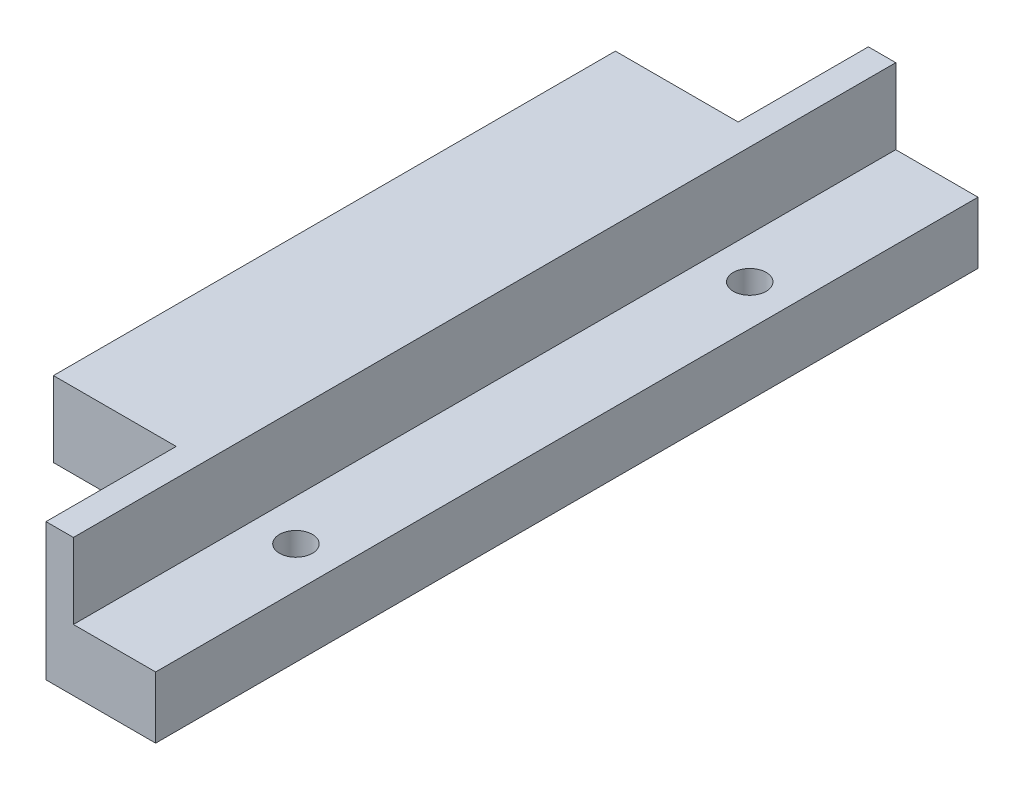
ISO-10303-21;
HEADER;
FILE_DESCRIPTION(('STEP AP214'),'2;1');
FILE_NAME('part.step','',(''),(''),'','','');
FILE_SCHEMA(('AUTOMOTIVE_DESIGN { 1 0 10303 214 1 1 1 1 }'));
ENDSEC;
DATA;
#1=APPLICATION_CONTEXT('core data for automotive mechanical design processes');
#2=APPLICATION_PROTOCOL_DEFINITION('international standard','automotive_design',2000,#1);
#3=PRODUCT_CONTEXT('',#1,'mechanical');
#4=PRODUCT('Part','Part','',(#3));
#5=PRODUCT_RELATED_PRODUCT_CATEGORY('part','',(#4));
#6=PRODUCT_DEFINITION_FORMATION('','',#4);
#7=PRODUCT_DEFINITION_CONTEXT('part definition',#1,'design');
#8=PRODUCT_DEFINITION('design','',#6,#7);
#9=PRODUCT_DEFINITION_SHAPE('','',#8);
#10=(LENGTH_UNIT() NAMED_UNIT(*) SI_UNIT(.MILLI.,.METRE.));
#11=(NAMED_UNIT(*) PLANE_ANGLE_UNIT() SI_UNIT($,.RADIAN.));
#12=(NAMED_UNIT(*) SI_UNIT($,.STERADIAN.) SOLID_ANGLE_UNIT());
#13=UNCERTAINTY_MEASURE_WITH_UNIT(LENGTH_MEASURE(1.E-05),#10,'distance_accuracy_value','');
#14=(GEOMETRIC_REPRESENTATION_CONTEXT(3) GLOBAL_UNCERTAINTY_ASSIGNED_CONTEXT((#13)) GLOBAL_UNIT_ASSIGNED_CONTEXT((#10,
#11,#12)) REPRESENTATION_CONTEXT('',''));
#15=CARTESIAN_POINT('',(0.,0.,0.));
#16=DIRECTION('',(0.,0.,1.));
#17=DIRECTION('',(1.,0.,0.));
#18=AXIS2_PLACEMENT_3D('',#15,#16,#17);
#19=CARTESIAN_POINT('',(0.,4.5,0.));
#20=DIRECTION('',(0.,1.,0.));
#21=DIRECTION('',(0.,0.,1.));
#22=AXIS2_PLACEMENT_3D('',#19,#20,#21);
#23=PLANE('',#22);
#24=DIRECTION('',(1.,0.,0.));
#25=VECTOR('',#24,1.);
#26=CARTESIAN_POINT('',(0.,4.5,-2.19044505921079));
#27=LINE('',#26,#25);
#28=CARTESIAN_POINT('',(-10.2777777777778,4.5,-2.19044505921079));
#29=VERTEX_POINT('',#28);
#30=CARTESIAN_POINT('',(-5.77777777777779,4.5,-2.19044505921079));
#31=VERTEX_POINT('',#30);
#32=EDGE_CURVE('E216',#29,#31,#27,.T.);
#33=ORIENTED_EDGE('',*,*,#32,.T.);
#34=DIRECTION('',(0.,0.,1.));
#35=VECTOR('',#34,1.);
#36=CARTESIAN_POINT('',(-5.77777777777779,4.5,3.80955494078921));
#37=LINE('',#36,#35);
#38=CARTESIAN_POINT('',(-5.77777777777779,4.5,-5.69044505921079));
#39=VERTEX_POINT('',#38);
#40=EDGE_CURVE('E186',#39,#31,#37,.T.);
#41=ORIENTED_EDGE('',*,*,#40,.F.);
#42=DIRECTION('',(1.,0.,0.));
#43=VECTOR('',#42,1.);
#44=CARTESIAN_POINT('',(-10.7347815598972,4.5,-5.69044505921079));
#45=LINE('',#44,#43);
#46=CARTESIAN_POINT('',(-10.2777777777778,4.5,-5.69044505921079));
#47=VERTEX_POINT('',#46);
#48=EDGE_CURVE('E11',#47,#39,#45,.T.);
#49=ORIENTED_EDGE('',*,*,#48,.F.);
#50=DIRECTION('',(0.,0.,1.));
#51=VECTOR('',#50,1.);
#52=CARTESIAN_POINT('',(-10.2777777777778,4.5,0.));
#53=LINE('',#52,#51);
#54=EDGE_CURVE('E94',#47,#29,#53,.T.);
#55=ORIENTED_EDGE('',*,*,#54,.T.);
#56=EDGE_LOOP('',(#33,#41,#49,#55));
#57=FACE_BOUND('',#56,.T.);
#58=ADVANCED_FACE('F35',(#57),#23,.T.);
#59=DIRECTION('',(-1.,0.,0.));
#60=VECTOR('',#59,1.);
#61=CARTESIAN_POINT('',(-10.7347815598972,4.5,-46.6904450592108));
#62=LINE('',#61,#60);
#63=CARTESIAN_POINT('',(-5.77777777777779,4.5,-46.6904450592108));
#64=VERTEX_POINT('',#63);
#65=CARTESIAN_POINT('',(-10.2777777777778,4.5,-46.6904450592108));
#66=VERTEX_POINT('',#65);
#67=EDGE_CURVE('E211',#64,#66,#62,.T.);
#68=ORIENTED_EDGE('',*,*,#67,.F.);
#69=CARTESIAN_POINT('',(-5.77777777777779,4.5,-50.1904450592108));
#70=VERTEX_POINT('',#69);
#71=EDGE_CURVE('E199',#70,#64,#37,.T.);
#72=ORIENTED_EDGE('',*,*,#71,.F.);
#73=DIRECTION('',(1.,0.,0.));
#74=VECTOR('',#73,1.);
#75=CARTESIAN_POINT('',(0.,4.5,-50.1904450592108));
#76=LINE('',#75,#74);
#77=CARTESIAN_POINT('',(-10.2777777777778,4.5,-50.1904450592108));
#78=VERTEX_POINT('',#77);
#79=EDGE_CURVE('E226',#78,#70,#76,.T.);
#80=ORIENTED_EDGE('',*,*,#79,.F.);
#81=EDGE_CURVE('E213',#78,#66,#53,.T.);
#82=ORIENTED_EDGE('',*,*,#81,.T.);
#83=EDGE_LOOP('',(#68,#72,#80,#82));
#84=FACE_BOUND('',#83,.T.);
#85=ADVANCED_FACE('F304',(#84),#23,.T.);
#86=CARTESIAN_POINT('',(-0.754308825333401,4.5,-9.40353781089534));
#87=DIRECTION('',(0.,1.,0.));
#88=DIRECTION('',(0.,0.,1.));
#89=AXIS2_PLACEMENT_3D('',#86,#87,#88);
#90=CIRCLE('',#89,1.19999999999999);
#91=CARTESIAN_POINT('',(-0.754308825333401,4.5,-8.20353781089535));
#92=VERTEX_POINT('',#91);
#93=EDGE_CURVE('E337',#92,#92,#90,.T.);
#94=ORIENTED_EDGE('',*,*,#93,.F.);
#95=EDGE_LOOP('',(#94));
#96=FACE_BOUND('',#95,.T.);
#97=CARTESIAN_POINT('',(-0.754308825333401,4.5,-42.5115439540475));
#98=DIRECTION('',(0.,1.,0.));
#99=DIRECTION('',(0.,0.,1.));
#100=AXIS2_PLACEMENT_3D('',#97,#98,#99);
#101=CIRCLE('',#100,1.19999999999999);
#102=CARTESIAN_POINT('',(-0.754308825333401,4.5,-41.3115439540475));
#103=VERTEX_POINT('',#102);
#104=EDGE_CURVE('E180',#103,#103,#101,.T.);
#105=ORIENTED_EDGE('',*,*,#104,.F.);
#106=EDGE_LOOP('',(#105));
#107=FACE_BOUND('',#106,.T.);
#108=DIRECTION('',(1.,0.,0.));
#109=VECTOR('',#108,1.);
#110=CARTESIAN_POINT('',(0.,4.5,-56.1904450592108));
#111=LINE('',#110,#109);
#112=CARTESIAN_POINT('',(-3.77777777777779,4.5,-56.1904450592108));
#113=VERTEX_POINT('',#112);
#114=CARTESIAN_POINT('',(2.22222222222221,4.5,-56.1904450592108));
#115=VERTEX_POINT('',#114);
#116=EDGE_CURVE('E224',#113,#115,#111,.T.);
#117=ORIENTED_EDGE('',*,*,#116,.F.);
#118=DIRECTION('',(0.,0.,-1.));
#119=VECTOR('',#118,1.);
#120=CARTESIAN_POINT('',(-3.77777777777779,4.5,3.80955494078921));
#121=LINE('',#120,#119);
#122=CARTESIAN_POINT('',(-3.77777777777779,4.5,3.80955494078921));
#123=VERTEX_POINT('',#122);
#124=EDGE_CURVE('E200',#123,#113,#121,.T.);
#125=ORIENTED_EDGE('',*,*,#124,.F.);
#126=DIRECTION('',(1.,0.,0.));
#127=VECTOR('',#126,1.);
#128=CARTESIAN_POINT('',(0.,4.5,3.80955494078921));
#129=LINE('',#128,#127);
#130=CARTESIAN_POINT('',(2.22222222222222,4.5,3.80955494078921));
#131=VERTEX_POINT('',#130);
#132=EDGE_CURVE('E219',#123,#131,#129,.T.);
#133=ORIENTED_EDGE('',*,*,#132,.T.);
#134=DIRECTION('',(0.,0.,1.));
#135=VECTOR('',#134,1.);
#136=CARTESIAN_POINT('',(2.22222222222222,4.5,0.));
#137=LINE('',#136,#135);
#138=EDGE_CURVE('E221',#115,#131,#137,.T.);
#139=ORIENTED_EDGE('',*,*,#138,.F.);
#140=EDGE_LOOP('',(#117,#125,#133,#139));
#141=FACE_BOUND('',#140,.T.);
#142=ADVANCED_FACE('F323',(#96,#107,#141),#23,.T.);
#143=CARTESIAN_POINT('',(-10.7347815598972,10.,-46.6904450592108));
#144=DIRECTION('',(0.,0.,1.));
#145=DIRECTION('',(1.,0.,0.));
#146=AXIS2_PLACEMENT_3D('',#143,#144,#145);
#147=PLANE('',#146);
#148=DIRECTION('',(0.,1.,0.));
#149=VECTOR('',#148,1.);
#150=CARTESIAN_POINT('',(-5.77777777777779,10.,-46.6904450592108));
#151=LINE('',#150,#149);
#152=CARTESIAN_POINT('',(-5.77777777777779,10.,-46.6904450592108));
#153=VERTEX_POINT('',#152);
#154=EDGE_CURVE('E207',#64,#153,#151,.T.);
#155=ORIENTED_EDGE('',*,*,#154,.F.);
#156=ORIENTED_EDGE('',*,*,#67,.T.);
#157=CARTESIAN_POINT('',(-14.7347815598972,4.5,-46.6904450592108));
#158=VERTEX_POINT('',#157);
#159=EDGE_CURVE('E209',#66,#158,#62,.T.);
#160=ORIENTED_EDGE('',*,*,#159,.T.);
#161=DIRECTION('',(0.,-1.,0.));
#162=VECTOR('',#161,1.);
#163=CARTESIAN_POINT('',(-14.7347815598972,10.,-46.6904450592108));
#164=LINE('',#163,#162);
#165=CARTESIAN_POINT('',(-14.7347815598972,10.,-46.6904450592108));
#166=VERTEX_POINT('',#165);
#167=EDGE_CURVE('E171',#166,#158,#164,.T.);
#168=ORIENTED_EDGE('',*,*,#167,.F.);
#169=DIRECTION('',(-1.,0.,0.));
#170=VECTOR('',#169,1.);
#171=CARTESIAN_POINT('',(-10.7347815598972,10.,-46.6904450592108));
#172=LINE('',#171,#170);
#173=EDGE_CURVE('E161',#153,#166,#172,.T.);
#174=ORIENTED_EDGE('',*,*,#173,.F.);
#175=EDGE_LOOP('',(#155,#156,#160,#168,#174));
#176=FACE_BOUND('',#175,.T.);
#177=ADVANCED_FACE('F302',(#176),#147,.F.);
#178=CARTESIAN_POINT('',(-10.7347815598972,10.,-5.69044505921079));
#179=DIRECTION('',(0.,0.,-1.));
#180=DIRECTION('',(-1.,0.,0.));
#181=AXIS2_PLACEMENT_3D('',#178,#179,#180);
#182=PLANE('',#181);
#183=DIRECTION('',(0.,-1.,0.));
#184=VECTOR('',#183,1.);
#185=CARTESIAN_POINT('',(-5.77777777777779,10.,-5.69044505921079));
#186=LINE('',#185,#184);
#187=CARTESIAN_POINT('',(-5.77777777777779,10.,-5.69044505921079));
#188=VERTEX_POINT('',#187);
#189=EDGE_CURVE('E157',#188,#39,#186,.T.);
#190=ORIENTED_EDGE('',*,*,#189,.F.);
#191=DIRECTION('',(1.,0.,0.));
#192=VECTOR('',#191,1.);
#193=CARTESIAN_POINT('',(-10.7347815598972,10.,-5.69044505921079));
#194=LINE('',#193,#192);
#195=CARTESIAN_POINT('',(-14.7347815598972,10.,-5.69044505921079));
#196=VERTEX_POINT('',#195);
#197=EDGE_CURVE('E151',#196,#188,#194,.T.);
#198=ORIENTED_EDGE('',*,*,#197,.F.);
#199=DIRECTION('',(0.,1.,0.));
#200=VECTOR('',#199,1.);
#201=CARTESIAN_POINT('',(-14.7347815598972,10.,-5.69044505921079));
#202=LINE('',#201,#200);
#203=CARTESIAN_POINT('',(-14.7347815598972,4.5,-5.69044505921078));
#204=VERTEX_POINT('',#203);
#205=EDGE_CURVE('E156',#204,#196,#202,.T.);
#206=ORIENTED_EDGE('',*,*,#205,.F.);
#207=EDGE_CURVE('E45',#204,#47,#45,.T.);
#208=ORIENTED_EDGE('',*,*,#207,.T.);
#209=ORIENTED_EDGE('',*,*,#48,.T.);
#210=EDGE_LOOP('',(#190,#198,#206,#208,#209));
#211=FACE_BOUND('',#210,.T.);
#212=ADVANCED_FACE('F153',(#211),#182,.F.);
#213=CARTESIAN_POINT('',(-10.2777777777778,4.5,0.));
#214=DIRECTION('',(1.,0.,0.));
#215=DIRECTION('',(0.,0.,-1.));
#216=AXIS2_PLACEMENT_3D('',#213,#214,#215);
#217=PLANE('',#216);
#218=DIRECTION('',(0.,0.,1.));
#219=VECTOR('',#218,1.);
#220=CARTESIAN_POINT('',(-10.2777777777778,0.,0.));
#221=LINE('',#220,#219);
#222=CARTESIAN_POINT('',(-10.2777777777778,0.,-50.1904450592108));
#223=VERTEX_POINT('',#222);
#224=CARTESIAN_POINT('',(-10.2777777777778,0.,-2.19044505921079));
#225=VERTEX_POINT('',#224);
#226=EDGE_CURVE('E160',#223,#225,#221,.T.);
#227=ORIENTED_EDGE('',*,*,#226,.T.);
#228=DIRECTION('',(0.,-1.,0.));
#229=VECTOR('',#228,1.);
#230=CARTESIAN_POINT('',(-10.2777777777778,4.5,-2.19044505921079));
#231=LINE('',#230,#229);
#232=EDGE_CURVE('E39',#29,#225,#231,.T.);
#233=ORIENTED_EDGE('',*,*,#232,.F.);
#234=ORIENTED_EDGE('',*,*,#54,.F.);
#235=EDGE_CURVE('E217',#66,#47,#53,.T.);
#236=ORIENTED_EDGE('',*,*,#235,.F.);
#237=ORIENTED_EDGE('',*,*,#81,.F.);
#238=DIRECTION('',(0.,-1.,0.));
#239=VECTOR('',#238,1.);
#240=CARTESIAN_POINT('',(-10.2777777777778,4.5,-50.1904450592108));
#241=LINE('',#240,#239);
#242=EDGE_CURVE('E59',#78,#223,#241,.T.);
#243=ORIENTED_EDGE('',*,*,#242,.T.);
#244=EDGE_LOOP('',(#227,#233,#234,#236,#237,#243));
#245=FACE_BOUND('',#244,.T.);
#246=ADVANCED_FACE('F37',(#245),#217,.F.);
#247=CARTESIAN_POINT('',(0.,4.5,-2.19044505921079));
#248=DIRECTION('',(0.,0.,-1.));
#249=DIRECTION('',(-1.,0.,0.));
#250=AXIS2_PLACEMENT_3D('',#247,#248,#249);
#251=PLANE('',#250);
#252=DIRECTION('',(1.,0.,0.));
#253=VECTOR('',#252,1.);
#254=CARTESIAN_POINT('',(0.,0.,-2.19044505921079));
#255=LINE('',#254,#253);
#256=CARTESIAN_POINT('',(-5.77777777777779,0.,-2.19044505921079));
#257=VERTEX_POINT('',#256);
#258=EDGE_CURVE('E229',#225,#257,#255,.T.);
#259=ORIENTED_EDGE('',*,*,#258,.T.);
#260=DIRECTION('',(0.,-1.,0.));
#261=VECTOR('',#260,1.);
#262=CARTESIAN_POINT('',(-5.77777777777779,4.5,-2.19044505921079));
#263=LINE('',#262,#261);
#264=EDGE_CURVE('E257',#31,#257,#263,.T.);
#265=ORIENTED_EDGE('',*,*,#264,.F.);
#266=ORIENTED_EDGE('',*,*,#32,.F.);
#267=ORIENTED_EDGE('',*,*,#232,.T.);
#268=EDGE_LOOP('',(#259,#265,#266,#267));
#269=FACE_BOUND('',#268,.T.);
#270=ADVANCED_FACE('F265',(#269),#251,.F.);
#271=CARTESIAN_POINT('',(-5.77777777777779,4.5,0.));
#272=DIRECTION('',(1.,0.,0.));
#273=DIRECTION('',(0.,0.,-1.));
#274=AXIS2_PLACEMENT_3D('',#271,#272,#273);
#275=PLANE('',#274);
#276=DIRECTION('',(0.,0.,1.));
#277=VECTOR('',#276,1.);
#278=CARTESIAN_POINT('',(-5.77777777777779,0.,0.));
#279=LINE('',#278,#277);
#280=CARTESIAN_POINT('',(-5.77777777777778,0.,3.80955494078921));
#281=VERTEX_POINT('',#280);
#282=EDGE_CURVE('E231',#257,#281,#279,.T.);
#283=ORIENTED_EDGE('',*,*,#282,.T.);
#284=DIRECTION('',(0.,-1.,0.));
#285=VECTOR('',#284,1.);
#286=CARTESIAN_POINT('',(-5.77777777777778,4.5,3.80955494078921));
#287=LINE('',#286,#285);
#288=CARTESIAN_POINT('',(-5.77777777777779,10.,3.80955494078921));
#289=VERTEX_POINT('',#288);
#290=EDGE_CURVE('E255',#289,#281,#287,.T.);
#291=ORIENTED_EDGE('',*,*,#290,.F.);
#292=DIRECTION('',(0.,0.,1.));
#293=VECTOR('',#292,1.);
#294=CARTESIAN_POINT('',(-5.77777777777779,10.,3.80955494078921));
#295=LINE('',#294,#293);
#296=EDGE_CURVE('E190',#188,#289,#295,.T.);
#297=ORIENTED_EDGE('',*,*,#296,.F.);
#298=ORIENTED_EDGE('',*,*,#189,.T.);
#299=ORIENTED_EDGE('',*,*,#40,.T.);
#300=ORIENTED_EDGE('',*,*,#264,.T.);
#301=EDGE_LOOP('',(#283,#291,#297,#298,#299,#300));
#302=FACE_BOUND('',#301,.T.);
#303=ADVANCED_FACE('F293',(#302),#275,.F.);
#304=CARTESIAN_POINT('',(0.,4.5,3.80955494078921));
#305=DIRECTION('',(0.,0.,-1.));
#306=DIRECTION('',(-1.,0.,0.));
#307=AXIS2_PLACEMENT_3D('',#304,#305,#306);
#308=PLANE('',#307);
#309=DIRECTION('',(1.,0.,0.));
#310=VECTOR('',#309,1.);
#311=CARTESIAN_POINT('',(0.,0.,3.80955494078921));
#312=LINE('',#311,#310);
#313=CARTESIAN_POINT('',(2.22222222222222,0.,3.80955494078921));
#314=VERTEX_POINT('',#313);
#315=EDGE_CURVE('E233',#281,#314,#312,.T.);
#316=ORIENTED_EDGE('',*,*,#315,.T.);
#317=DIRECTION('',(0.,-1.,0.));
#318=VECTOR('',#317,1.);
#319=CARTESIAN_POINT('',(2.22222222222222,4.5,3.80955494078921));
#320=LINE('',#319,#318);
#321=EDGE_CURVE('E253',#131,#314,#320,.T.);
#322=ORIENTED_EDGE('',*,*,#321,.F.);
#323=ORIENTED_EDGE('',*,*,#132,.F.);
#324=DIRECTION('',(0.,-1.,0.));
#325=VECTOR('',#324,1.);
#326=CARTESIAN_POINT('',(-3.77777777777779,10.,3.80955494078921));
#327=LINE('',#326,#325);
#328=CARTESIAN_POINT('',(-3.77777777777779,10.,3.80955494078921));
#329=VERTEX_POINT('',#328);
#330=EDGE_CURVE('E204',#329,#123,#327,.T.);
#331=ORIENTED_EDGE('',*,*,#330,.F.);
#332=DIRECTION('',(1.,0.,0.));
#333=VECTOR('',#332,1.);
#334=CARTESIAN_POINT('',(-3.77777777777779,10.,3.80955494078921));
#335=LINE('',#334,#333);
#336=EDGE_CURVE('E189',#289,#329,#335,.T.);
#337=ORIENTED_EDGE('',*,*,#336,.F.);
#338=ORIENTED_EDGE('',*,*,#290,.T.);
#339=EDGE_LOOP('',(#316,#322,#323,#331,#337,#338));
#340=FACE_BOUND('',#339,.T.);
#341=ADVANCED_FACE('F289',(#340),#308,.F.);
#342=CARTESIAN_POINT('',(2.22222222222222,4.5,0.));
#343=DIRECTION('',(1.,0.,0.));
#344=DIRECTION('',(0.,0.,-1.));
#345=AXIS2_PLACEMENT_3D('',#342,#343,#344);
#346=PLANE('',#345);
#347=DIRECTION('',(0.,0.,1.));
#348=VECTOR('',#347,1.);
#349=CARTESIAN_POINT('',(2.22222222222222,0.,0.));
#350=LINE('',#349,#348);
#351=CARTESIAN_POINT('',(2.22222222222221,0.,-56.1904450592108));
#352=VERTEX_POINT('',#351);
#353=EDGE_CURVE('E237',#352,#314,#350,.T.);
#354=ORIENTED_EDGE('',*,*,#353,.F.);
#355=DIRECTION('',(0.,-1.,0.));
#356=VECTOR('',#355,1.);
#357=CARTESIAN_POINT('',(2.22222222222221,4.5,-56.1904450592108));
#358=LINE('',#357,#356);
#359=EDGE_CURVE('E251',#115,#352,#358,.T.);
#360=ORIENTED_EDGE('',*,*,#359,.F.);
#361=ORIENTED_EDGE('',*,*,#138,.T.);
#362=ORIENTED_EDGE('',*,*,#321,.T.);
#363=EDGE_LOOP('',(#354,#360,#361,#362));
#364=FACE_BOUND('',#363,.T.);
#365=ADVANCED_FACE('F285',(#364),#346,.T.);
#366=CARTESIAN_POINT('',(0.,4.5,-56.1904450592108));
#367=DIRECTION('',(0.,0.,-1.));
#368=DIRECTION('',(-1.,0.,0.));
#369=AXIS2_PLACEMENT_3D('',#366,#367,#368);
#370=PLANE('',#369);
#371=DIRECTION('',(1.,0.,0.));
#372=VECTOR('',#371,1.);
#373=CARTESIAN_POINT('',(0.,0.,-56.1904450592108));
#374=LINE('',#373,#372);
#375=CARTESIAN_POINT('',(-5.77777777777779,0.,-56.1904450592108));
#376=VERTEX_POINT('',#375);
#377=EDGE_CURVE('E240',#376,#352,#374,.T.);
#378=ORIENTED_EDGE('',*,*,#377,.F.);
#379=DIRECTION('',(0.,-1.,0.));
#380=VECTOR('',#379,1.);
#381=CARTESIAN_POINT('',(-5.77777777777779,4.5,-56.1904450592108));
#382=LINE('',#381,#380);
#383=CARTESIAN_POINT('',(-5.77777777777779,10.,-56.1904450592108));
#384=VERTEX_POINT('',#383);
#385=EDGE_CURVE('E249',#384,#376,#382,.T.);
#386=ORIENTED_EDGE('',*,*,#385,.F.);
#387=DIRECTION('',(-1.,0.,0.));
#388=VECTOR('',#387,1.);
#389=CARTESIAN_POINT('',(-3.77777777777779,10.,-56.1904450592108));
#390=LINE('',#389,#388);
#391=CARTESIAN_POINT('',(-3.77777777777779,10.,-56.1904450592108));
#392=VERTEX_POINT('',#391);
#393=EDGE_CURVE('E194',#392,#384,#390,.T.);
#394=ORIENTED_EDGE('',*,*,#393,.F.);
#395=DIRECTION('',(0.,-1.,0.));
#396=VECTOR('',#395,1.);
#397=CARTESIAN_POINT('',(-3.77777777777779,10.,-56.1904450592108));
#398=LINE('',#397,#396);
#399=EDGE_CURVE('E197',#392,#113,#398,.T.);
#400=ORIENTED_EDGE('',*,*,#399,.T.);
#401=ORIENTED_EDGE('',*,*,#116,.T.);
#402=ORIENTED_EDGE('',*,*,#359,.T.);
#403=EDGE_LOOP('',(#378,#386,#394,#400,#401,#402));
#404=FACE_BOUND('',#403,.T.);
#405=ADVANCED_FACE('F278',(#404),#370,.T.);
#406=CARTESIAN_POINT('',(-5.77777777777779,0.,-50.1904450592108));
#407=VERTEX_POINT('',#406);
#408=EDGE_CURVE('E234',#376,#407,#279,.T.);
#409=ORIENTED_EDGE('',*,*,#408,.T.);
#410=DIRECTION('',(0.,-1.,0.));
#411=VECTOR('',#410,1.);
#412=CARTESIAN_POINT('',(-5.77777777777779,4.5,-50.1904450592108));
#413=LINE('',#412,#411);
#414=EDGE_CURVE('E247',#70,#407,#413,.T.);
#415=ORIENTED_EDGE('',*,*,#414,.F.);
#416=ORIENTED_EDGE('',*,*,#71,.T.);
#417=ORIENTED_EDGE('',*,*,#154,.T.);
#418=EDGE_CURVE('E187',#384,#153,#295,.T.);
#419=ORIENTED_EDGE('',*,*,#418,.F.);
#420=ORIENTED_EDGE('',*,*,#385,.T.);
#421=EDGE_LOOP('',(#409,#415,#416,#417,#419,#420));
#422=FACE_BOUND('',#421,.T.);
#423=ADVANCED_FACE('F274',(#422),#275,.F.);
#424=CARTESIAN_POINT('',(0.,4.5,-50.1904450592108));
#425=DIRECTION('',(0.,0.,-1.));
#426=DIRECTION('',(-1.,0.,0.));
#427=AXIS2_PLACEMENT_3D('',#424,#425,#426);
#428=PLANE('',#427);
#429=DIRECTION('',(1.,0.,0.));
#430=VECTOR('',#429,1.);
#431=CARTESIAN_POINT('',(0.,0.,-50.1904450592108));
#432=LINE('',#431,#430);
#433=EDGE_CURVE('E243',#223,#407,#432,.T.);
#434=ORIENTED_EDGE('',*,*,#433,.F.);
#435=ORIENTED_EDGE('',*,*,#242,.F.);
#436=ORIENTED_EDGE('',*,*,#79,.T.);
#437=ORIENTED_EDGE('',*,*,#414,.T.);
#438=EDGE_LOOP('',(#434,#435,#436,#437));
#439=FACE_BOUND('',#438,.T.);
#440=ADVANCED_FACE('F269',(#439),#428,.T.);
#441=CARTESIAN_POINT('',(0.,0.,0.));
#442=DIRECTION('',(0.,1.,0.));
#443=DIRECTION('',(0.,0.,1.));
#444=AXIS2_PLACEMENT_3D('',#441,#442,#443);
#445=PLANE('',#444);
#446=CARTESIAN_POINT('',(-0.754308825333401,0.,-9.40353781089534));
#447=DIRECTION('',(0.,1.,0.));
#448=DIRECTION('',(0.,0.,1.));
#449=AXIS2_PLACEMENT_3D('',#446,#447,#448);
#450=CIRCLE('',#449,1.2);
#451=CARTESIAN_POINT('',(-0.754308825333401,0.,-8.20353781089534));
#452=VERTEX_POINT('',#451);
#453=EDGE_CURVE('E342',#452,#452,#450,.T.);
#454=ORIENTED_EDGE('',*,*,#453,.T.);
#455=EDGE_LOOP('',(#454));
#456=FACE_BOUND('',#455,.T.);
#457=CARTESIAN_POINT('',(-0.754308825333401,0.,-42.5115439540475));
#458=DIRECTION('',(0.,1.,0.));
#459=DIRECTION('',(0.,0.,1.));
#460=AXIS2_PLACEMENT_3D('',#457,#458,#459);
#461=CIRCLE('',#460,1.2);
#462=CARTESIAN_POINT('',(-0.754308825333401,0.,-41.3115439540475));
#463=VERTEX_POINT('',#462);
#464=EDGE_CURVE('E177',#463,#463,#461,.T.);
#465=ORIENTED_EDGE('',*,*,#464,.T.);
#466=EDGE_LOOP('',(#465));
#467=FACE_BOUND('',#466,.T.);
#468=ORIENTED_EDGE('',*,*,#226,.F.);
#469=ORIENTED_EDGE('',*,*,#433,.T.);
#470=ORIENTED_EDGE('',*,*,#408,.F.);
#471=ORIENTED_EDGE('',*,*,#377,.T.);
#472=ORIENTED_EDGE('',*,*,#353,.T.);
#473=ORIENTED_EDGE('',*,*,#315,.F.);
#474=ORIENTED_EDGE('',*,*,#282,.F.);
#475=ORIENTED_EDGE('',*,*,#258,.F.);
#476=EDGE_LOOP('',(#468,#469,#470,#471,#472,#473,#474,#475));
#477=FACE_BOUND('',#476,.T.);
#478=ADVANCED_FACE('F267',(#456,#467,#477),#445,.F.);
#479=CARTESIAN_POINT('',(0.,4.5,0.));
#480=DIRECTION('',(0.,1.,0.));
#481=DIRECTION('',(0.,0.,1.));
#482=AXIS2_PLACEMENT_3D('',#479,#480,#481);
#483=PLANE('',#482);
#484=ORIENTED_EDGE('',*,*,#159,.F.);
#485=ORIENTED_EDGE('',*,*,#235,.T.);
#486=ORIENTED_EDGE('',*,*,#207,.F.);
#487=DIRECTION('',(0.,0.,1.));
#488=VECTOR('',#487,1.);
#489=CARTESIAN_POINT('',(-14.7347815598972,4.5,-46.6904450592108));
#490=LINE('',#489,#488);
#491=EDGE_CURVE('E176',#158,#204,#490,.T.);
#492=ORIENTED_EDGE('',*,*,#491,.F.);
#493=EDGE_LOOP('',(#484,#485,#486,#492));
#494=FACE_BOUND('',#493,.T.);
#495=ADVANCED_FACE('F309',(#494),#483,.F.);
#496=CARTESIAN_POINT('',(0.,10.,0.));
#497=DIRECTION('',(0.,1.,0.));
#498=DIRECTION('',(0.,0.,1.));
#499=AXIS2_PLACEMENT_3D('',#496,#497,#498);
#500=PLANE('',#499);
#501=ORIENTED_EDGE('',*,*,#418,.T.);
#502=ORIENTED_EDGE('',*,*,#173,.T.);
#503=DIRECTION('',(0.,0.,-1.));
#504=VECTOR('',#503,1.);
#505=CARTESIAN_POINT('',(-14.7347815598972,10.,-46.6904450592108));
#506=LINE('',#505,#504);
#507=EDGE_CURVE('E164',#196,#166,#506,.T.);
#508=ORIENTED_EDGE('',*,*,#507,.F.);
#509=ORIENTED_EDGE('',*,*,#197,.T.);
#510=ORIENTED_EDGE('',*,*,#296,.T.);
#511=ORIENTED_EDGE('',*,*,#336,.T.);
#512=DIRECTION('',(0.,0.,-1.));
#513=VECTOR('',#512,1.);
#514=CARTESIAN_POINT('',(-3.77777777777779,10.,3.80955494078921));
#515=LINE('',#514,#513);
#516=EDGE_CURVE('E192',#329,#392,#515,.T.);
#517=ORIENTED_EDGE('',*,*,#516,.T.);
#518=ORIENTED_EDGE('',*,*,#393,.T.);
#519=EDGE_LOOP('',(#501,#502,#508,#509,#510,#511,#517,#518));
#520=FACE_BOUND('',#519,.T.);
#521=ADVANCED_FACE('F166',(#520),#500,.T.);
#522=CARTESIAN_POINT('',(-3.77777777777779,10.,3.80955494078921));
#523=DIRECTION('',(-1.,0.,0.));
#524=DIRECTION('',(0.,0.,1.));
#525=AXIS2_PLACEMENT_3D('',#522,#523,#524);
#526=PLANE('',#525);
#527=ORIENTED_EDGE('',*,*,#124,.T.);
#528=ORIENTED_EDGE('',*,*,#399,.F.);
#529=ORIENTED_EDGE('',*,*,#516,.F.);
#530=ORIENTED_EDGE('',*,*,#330,.T.);
#531=EDGE_LOOP('',(#527,#528,#529,#530));
#532=FACE_BOUND('',#531,.T.);
#533=ADVANCED_FACE('F298',(#532),#526,.F.);
#534=CARTESIAN_POINT('',(-14.7347815598972,0.,0.));
#535=DIRECTION('',(-1.,0.,0.));
#536=DIRECTION('',(0.,0.,1.));
#537=AXIS2_PLACEMENT_3D('',#534,#535,#536);
#538=PLANE('',#537);
#539=ORIENTED_EDGE('',*,*,#205,.T.);
#540=ORIENTED_EDGE('',*,*,#507,.T.);
#541=ORIENTED_EDGE('',*,*,#167,.T.);
#542=ORIENTED_EDGE('',*,*,#491,.T.);
#543=EDGE_LOOP('',(#539,#540,#541,#542));
#544=FACE_BOUND('',#543,.T.);
#545=ADVANCED_FACE('F174',(#544),#538,.T.);
#546=CARTESIAN_POINT('',(-0.754308825333401,4.5,-42.5115439540475));
#547=DIRECTION('',(0.,1.,0.));
#548=DIRECTION('',(0.,0.,1.));
#549=AXIS2_PLACEMENT_3D('',#546,#547,#548);
#550=CYLINDRICAL_SURFACE('',#549,1.19999999999999);
#551=ORIENTED_EDGE('',*,*,#464,.F.);
#552=EDGE_LOOP('',(#551));
#553=FACE_BOUND('',#552,.T.);
#554=ORIENTED_EDGE('',*,*,#104,.T.);
#555=EDGE_LOOP('',(#554));
#556=FACE_BOUND('',#555,.T.);
#557=ADVANCED_FACE('F349',(#553,#556),#550,.F.);
#558=CARTESIAN_POINT('',(-0.754308825333401,4.5,-9.40353781089534));
#559=DIRECTION('',(0.,1.,0.));
#560=DIRECTION('',(0.,0.,1.));
#561=AXIS2_PLACEMENT_3D('',#558,#559,#560);
#562=CYLINDRICAL_SURFACE('',#561,1.19999999999999);
#563=ORIENTED_EDGE('',*,*,#453,.F.);
#564=EDGE_LOOP('',(#563));
#565=FACE_BOUND('',#564,.T.);
#566=ORIENTED_EDGE('',*,*,#93,.T.);
#567=EDGE_LOOP('',(#566));
#568=FACE_BOUND('',#567,.T.);
#569=ADVANCED_FACE('F347',(#565,#568),#562,.F.);
#570=CLOSED_SHELL('',(#58,#85,#142,#177,#212,#246,#270,#303,#341,#365,#405,#423,#440,#478,#495,
#521,#533,#545,#557,#569));
#571=MANIFOLD_SOLID_BREP('B2',#570);
#572=ADVANCED_BREP_SHAPE_REPRESENTATION('',(#18,#571),#14);
#573=SHAPE_DEFINITION_REPRESENTATION(#9,#572);
ENDSEC;
END-ISO-10303-21;
